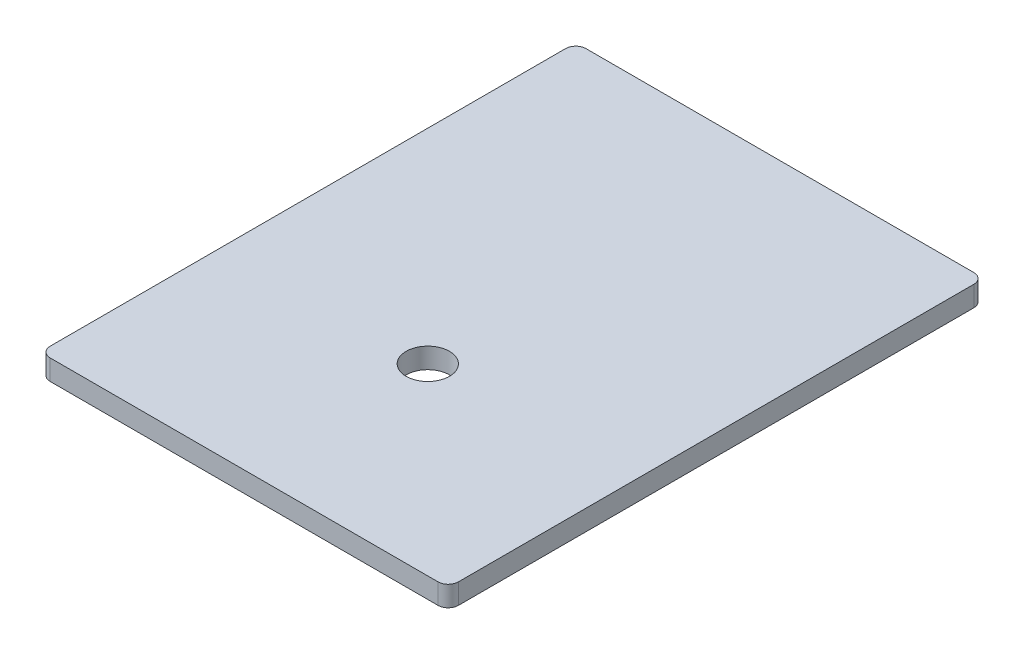
ISO-10303-21;
HEADER;
FILE_DESCRIPTION(('STEP AP214'),'2;1');
FILE_NAME('part.step','',(''),(''),'','','');
FILE_SCHEMA(('AUTOMOTIVE_DESIGN { 1 0 10303 214 1 1 1 1 }'));
ENDSEC;
DATA;
#1=APPLICATION_CONTEXT('core data for automotive mechanical design processes');
#2=APPLICATION_PROTOCOL_DEFINITION('international standard','automotive_design',2000,#1);
#3=PRODUCT_CONTEXT('',#1,'mechanical');
#4=PRODUCT('Part','Part','',(#3));
#5=PRODUCT_RELATED_PRODUCT_CATEGORY('part','',(#4));
#6=PRODUCT_DEFINITION_FORMATION('','',#4);
#7=PRODUCT_DEFINITION_CONTEXT('part definition',#1,'design');
#8=PRODUCT_DEFINITION('design','',#6,#7);
#9=PRODUCT_DEFINITION_SHAPE('','',#8);
#10=(LENGTH_UNIT() NAMED_UNIT(*) SI_UNIT(.MILLI.,.METRE.));
#11=(NAMED_UNIT(*) PLANE_ANGLE_UNIT() SI_UNIT($,.RADIAN.));
#12=(NAMED_UNIT(*) SI_UNIT($,.STERADIAN.) SOLID_ANGLE_UNIT());
#13=UNCERTAINTY_MEASURE_WITH_UNIT(LENGTH_MEASURE(1.E-05),#10,'distance_accuracy_value','');
#14=(GEOMETRIC_REPRESENTATION_CONTEXT(3) GLOBAL_UNCERTAINTY_ASSIGNED_CONTEXT((#13)) GLOBAL_UNIT_ASSIGNED_CONTEXT((#10,
#11,#12)) REPRESENTATION_CONTEXT('',''));
#15=CARTESIAN_POINT('',(0.,0.,0.));
#16=DIRECTION('',(0.,0.,1.));
#17=DIRECTION('',(1.,0.,0.));
#18=AXIS2_PLACEMENT_3D('',#15,#16,#17);
#19=CARTESIAN_POINT('',(-80.,-8.,-210.));
#20=DIRECTION('',(-1.,0.,0.));
#21=DIRECTION('',(0.,0.,1.));
#22=AXIS2_PLACEMENT_3D('',#19,#20,#21);
#23=PLANE('',#22);
#24=DIRECTION('',(0.,0.,1.));
#25=VECTOR('',#24,1.);
#26=CARTESIAN_POINT('',(-80.,0.,-210.));
#27=LINE('',#26,#25);
#28=CARTESIAN_POINT('',(-80.,0.,-206.));
#29=VERTEX_POINT('',#28);
#30=CARTESIAN_POINT('',(-80.,0.,-4.));
#31=VERTEX_POINT('',#30);
#32=EDGE_CURVE('E167',#29,#31,#27,.T.);
#33=ORIENTED_EDGE('',*,*,#32,.F.);
#34=DIRECTION('',(0.,1.,0.));
#35=VECTOR('',#34,1.);
#36=CARTESIAN_POINT('',(-80.,-8.,-206.));
#37=LINE('',#36,#35);
#38=CARTESIAN_POINT('',(-80.,-8.,-206.));
#39=VERTEX_POINT('',#38);
#40=EDGE_CURVE('E142',#29,#39,#37,.F.);
#41=ORIENTED_EDGE('',*,*,#40,.T.);
#42=DIRECTION('',(0.,0.,1.));
#43=VECTOR('',#42,1.);
#44=CARTESIAN_POINT('',(-80.,-8.,-210.));
#45=LINE('',#44,#43);
#46=CARTESIAN_POINT('',(-80.,-8.,-4.));
#47=VERTEX_POINT('',#46);
#48=EDGE_CURVE('E123',#39,#47,#45,.T.);
#49=ORIENTED_EDGE('',*,*,#48,.T.);
#50=DIRECTION('',(0.,1.,0.));
#51=VECTOR('',#50,1.);
#52=CARTESIAN_POINT('',(-80.,-8.,-4.));
#53=LINE('',#52,#51);
#54=EDGE_CURVE('E139',#47,#31,#53,.T.);
#55=ORIENTED_EDGE('',*,*,#54,.T.);
#56=EDGE_LOOP('',(#33,#41,#49,#55));
#57=FACE_BOUND('',#56,.T.);
#58=ADVANCED_FACE('F36',(#57),#23,.T.);
#59=CARTESIAN_POINT('',(-80.,-8.,-210.));
#60=DIRECTION('',(0.,0.,-1.));
#61=DIRECTION('',(-1.,0.,0.));
#62=AXIS2_PLACEMENT_3D('',#59,#60,#61);
#63=PLANE('',#62);
#64=DIRECTION('',(-1.,0.,0.));
#65=VECTOR('',#64,1.);
#66=CARTESIAN_POINT('',(-80.,-8.,-210.));
#67=LINE('',#66,#65);
#68=CARTESIAN_POINT('',(76.,-8.,-210.));
#69=VERTEX_POINT('',#68);
#70=CARTESIAN_POINT('',(-76.,-8.,-210.));
#71=VERTEX_POINT('',#70);
#72=EDGE_CURVE('E128',#69,#71,#67,.T.);
#73=ORIENTED_EDGE('',*,*,#72,.T.);
#74=DIRECTION('',(0.,1.,0.));
#75=VECTOR('',#74,1.);
#76=CARTESIAN_POINT('',(-76.,-8.,-210.));
#77=LINE('',#76,#75);
#78=CARTESIAN_POINT('',(-76.,0.,-210.));
#79=VERTEX_POINT('',#78);
#80=EDGE_CURVE('E122',#71,#79,#77,.T.);
#81=ORIENTED_EDGE('',*,*,#80,.T.);
#82=DIRECTION('',(-1.,0.,0.));
#83=VECTOR('',#82,1.);
#84=CARTESIAN_POINT('',(-80.,0.,-210.));
#85=LINE('',#84,#83);
#86=CARTESIAN_POINT('',(76.,0.,-210.));
#87=VERTEX_POINT('',#86);
#88=EDGE_CURVE('E106',#87,#79,#85,.T.);
#89=ORIENTED_EDGE('',*,*,#88,.F.);
#90=DIRECTION('',(0.,1.,0.));
#91=VECTOR('',#90,1.);
#92=CARTESIAN_POINT('',(76.,-8.,-210.));
#93=LINE('',#92,#91);
#94=EDGE_CURVE('E119',#87,#69,#93,.F.);
#95=ORIENTED_EDGE('',*,*,#94,.T.);
#96=EDGE_LOOP('',(#73,#81,#89,#95));
#97=FACE_BOUND('',#96,.T.);
#98=ADVANCED_FACE('F118',(#97),#63,.T.);
#99=CARTESIAN_POINT('',(80.,-8.,-210.));
#100=DIRECTION('',(1.,0.,0.));
#101=DIRECTION('',(0.,0.,-1.));
#102=AXIS2_PLACEMENT_3D('',#99,#100,#101);
#103=PLANE('',#102);
#104=DIRECTION('',(0.,0.,-1.));
#105=VECTOR('',#104,1.);
#106=CARTESIAN_POINT('',(80.,-8.,-210.));
#107=LINE('',#106,#105);
#108=CARTESIAN_POINT('',(80.,-8.,-4.));
#109=VERTEX_POINT('',#108);
#110=CARTESIAN_POINT('',(80.,-8.,-206.));
#111=VERTEX_POINT('',#110);
#112=EDGE_CURVE('E131',#109,#111,#107,.T.);
#113=ORIENTED_EDGE('',*,*,#112,.T.);
#114=DIRECTION('',(0.,1.,0.));
#115=VECTOR('',#114,1.);
#116=CARTESIAN_POINT('',(80.,-8.,-206.));
#117=LINE('',#116,#115);
#118=CARTESIAN_POINT('',(80.,0.,-206.));
#119=VERTEX_POINT('',#118);
#120=EDGE_CURVE('E11',#111,#119,#117,.T.);
#121=ORIENTED_EDGE('',*,*,#120,.T.);
#122=DIRECTION('',(0.,0.,-1.));
#123=VECTOR('',#122,1.);
#124=CARTESIAN_POINT('',(80.,0.,-210.));
#125=LINE('',#124,#123);
#126=CARTESIAN_POINT('',(80.,0.,-4.));
#127=VERTEX_POINT('',#126);
#128=EDGE_CURVE('E108',#127,#119,#125,.T.);
#129=ORIENTED_EDGE('',*,*,#128,.F.);
#130=DIRECTION('',(0.,1.,0.));
#131=VECTOR('',#130,1.);
#132=CARTESIAN_POINT('',(80.,-8.,-4.));
#133=LINE('',#132,#131);
#134=EDGE_CURVE('E44',#127,#109,#133,.F.);
#135=ORIENTED_EDGE('',*,*,#134,.T.);
#136=EDGE_LOOP('',(#113,#121,#129,#135));
#137=FACE_BOUND('',#136,.T.);
#138=ADVANCED_FACE('F156',(#137),#103,.T.);
#139=CARTESIAN_POINT('',(-80.,-8.,0.));
#140=DIRECTION('',(0.,0.,1.));
#141=DIRECTION('',(1.,0.,0.));
#142=AXIS2_PLACEMENT_3D('',#139,#140,#141);
#143=PLANE('',#142);
#144=DIRECTION('',(1.,0.,0.));
#145=VECTOR('',#144,1.);
#146=CARTESIAN_POINT('',(-80.,0.,0.));
#147=LINE('',#146,#145);
#148=CARTESIAN_POINT('',(-76.,0.,0.));
#149=VERTEX_POINT('',#148);
#150=CARTESIAN_POINT('',(76.,0.,0.));
#151=VERTEX_POINT('',#150);
#152=EDGE_CURVE('E165',#149,#151,#147,.T.);
#153=ORIENTED_EDGE('',*,*,#152,.F.);
#154=DIRECTION('',(0.,1.,0.));
#155=VECTOR('',#154,1.);
#156=CARTESIAN_POINT('',(-76.,-8.,0.));
#157=LINE('',#156,#155);
#158=CARTESIAN_POINT('',(-76.,-8.,0.));
#159=VERTEX_POINT('',#158);
#160=EDGE_CURVE('E58',#149,#159,#157,.F.);
#161=ORIENTED_EDGE('',*,*,#160,.T.);
#162=DIRECTION('',(1.,0.,0.));
#163=VECTOR('',#162,1.);
#164=CARTESIAN_POINT('',(-80.,-8.,0.));
#165=LINE('',#164,#163);
#166=CARTESIAN_POINT('',(76.,-8.,0.));
#167=VERTEX_POINT('',#166);
#168=EDGE_CURVE('E160',#159,#167,#165,.T.);
#169=ORIENTED_EDGE('',*,*,#168,.T.);
#170=DIRECTION('',(0.,1.,0.));
#171=VECTOR('',#170,1.);
#172=CARTESIAN_POINT('',(76.,-8.,0.));
#173=LINE('',#172,#171);
#174=EDGE_CURVE('E150',#167,#151,#173,.T.);
#175=ORIENTED_EDGE('',*,*,#174,.T.);
#176=EDGE_LOOP('',(#153,#161,#169,#175));
#177=FACE_BOUND('',#176,.T.);
#178=ADVANCED_FACE('F164',(#177),#143,.T.);
#179=CARTESIAN_POINT('',(0.,-8.,0.));
#180=DIRECTION('',(0.,1.,0.));
#181=DIRECTION('',(0.,0.,1.));
#182=AXIS2_PLACEMENT_3D('',#179,#180,#181);
#183=PLANE('',#182);
#184=CARTESIAN_POINT('',(0.,-8.,-72.));
#185=DIRECTION('',(0.,1.,0.));
#186=DIRECTION('',(0.,0.,1.));
#187=AXIS2_PLACEMENT_3D('',#184,#185,#186);
#188=CIRCLE('',#187,8.5);
#189=CARTESIAN_POINT('',(0.,-8.,-63.5));
#190=VERTEX_POINT('',#189);
#191=EDGE_CURVE('E169',#190,#190,#188,.T.);
#192=ORIENTED_EDGE('',*,*,#191,.T.);
#193=EDGE_LOOP('',(#192));
#194=FACE_BOUND('',#193,.T.);
#195=ORIENTED_EDGE('',*,*,#48,.F.);
#196=CARTESIAN_POINT('',(-76.,-8.,-206.));
#197=DIRECTION('',(0.,1.,0.));
#198=DIRECTION('',(0.,0.,1.));
#199=AXIS2_PLACEMENT_3D('',#196,#197,#198);
#200=CIRCLE('',#199,4.);
#201=EDGE_CURVE('E148',#39,#71,#200,.F.);
#202=ORIENTED_EDGE('',*,*,#201,.T.);
#203=ORIENTED_EDGE('',*,*,#72,.F.);
#204=CARTESIAN_POINT('',(76.,-8.,-206.));
#205=DIRECTION('',(0.,1.,0.));
#206=DIRECTION('',(0.,0.,1.));
#207=AXIS2_PLACEMENT_3D('',#204,#205,#206);
#208=CIRCLE('',#207,4.);
#209=EDGE_CURVE('E127',#69,#111,#208,.F.);
#210=ORIENTED_EDGE('',*,*,#209,.T.);
#211=ORIENTED_EDGE('',*,*,#112,.F.);
#212=CARTESIAN_POINT('',(76.,-8.,-4.));
#213=DIRECTION('',(0.,1.,0.));
#214=DIRECTION('',(0.,0.,1.));
#215=AXIS2_PLACEMENT_3D('',#212,#213,#214);
#216=CIRCLE('',#215,4.);
#217=EDGE_CURVE('E51',#109,#167,#216,.F.);
#218=ORIENTED_EDGE('',*,*,#217,.T.);
#219=ORIENTED_EDGE('',*,*,#168,.F.);
#220=CARTESIAN_POINT('',(-76.,-8.,-4.));
#221=DIRECTION('',(0.,1.,0.));
#222=DIRECTION('',(0.,0.,1.));
#223=AXIS2_PLACEMENT_3D('',#220,#221,#222);
#224=CIRCLE('',#223,4.);
#225=EDGE_CURVE('E146',#159,#47,#224,.F.);
#226=ORIENTED_EDGE('',*,*,#225,.T.);
#227=EDGE_LOOP('',(#195,#202,#203,#210,#211,#218,#219,#226));
#228=FACE_BOUND('',#227,.T.);
#229=ADVANCED_FACE('F159',(#194,#228),#183,.F.);
#230=CARTESIAN_POINT('',(0.,0.,0.));
#231=DIRECTION('',(0.,1.,0.));
#232=DIRECTION('',(0.,0.,1.));
#233=AXIS2_PLACEMENT_3D('',#230,#231,#232);
#234=PLANE('',#233);
#235=CARTESIAN_POINT('',(0.,0.,-72.));
#236=DIRECTION('',(0.,1.,0.));
#237=DIRECTION('',(0.,0.,1.));
#238=AXIS2_PLACEMENT_3D('',#235,#236,#237);
#239=CIRCLE('',#238,8.5);
#240=CARTESIAN_POINT('',(0.,0.,-63.5));
#241=VERTEX_POINT('',#240);
#242=EDGE_CURVE('E177',#241,#241,#239,.T.);
#243=ORIENTED_EDGE('',*,*,#242,.F.);
#244=EDGE_LOOP('',(#243));
#245=FACE_BOUND('',#244,.T.);
#246=ORIENTED_EDGE('',*,*,#88,.T.);
#247=CARTESIAN_POINT('',(-76.,0.,-206.));
#248=DIRECTION('',(0.,1.,0.));
#249=DIRECTION('',(0.,0.,1.));
#250=AXIS2_PLACEMENT_3D('',#247,#248,#249);
#251=CIRCLE('',#250,4.);
#252=EDGE_CURVE('E137',#79,#29,#251,.T.);
#253=ORIENTED_EDGE('',*,*,#252,.T.);
#254=ORIENTED_EDGE('',*,*,#32,.T.);
#255=CARTESIAN_POINT('',(-76.,0.,-4.));
#256=DIRECTION('',(0.,1.,0.));
#257=DIRECTION('',(0.,0.,1.));
#258=AXIS2_PLACEMENT_3D('',#255,#256,#257);
#259=CIRCLE('',#258,4.);
#260=EDGE_CURVE('E112',#31,#149,#259,.T.);
#261=ORIENTED_EDGE('',*,*,#260,.T.);
#262=ORIENTED_EDGE('',*,*,#152,.T.);
#263=CARTESIAN_POINT('',(76.,0.,-4.));
#264=DIRECTION('',(0.,1.,0.));
#265=DIRECTION('',(0.,0.,1.));
#266=AXIS2_PLACEMENT_3D('',#263,#264,#265);
#267=CIRCLE('',#266,4.);
#268=EDGE_CURVE('E113',#151,#127,#267,.T.);
#269=ORIENTED_EDGE('',*,*,#268,.T.);
#270=ORIENTED_EDGE('',*,*,#128,.T.);
#271=CARTESIAN_POINT('',(76.,0.,-206.));
#272=DIRECTION('',(0.,1.,0.));
#273=DIRECTION('',(0.,0.,1.));
#274=AXIS2_PLACEMENT_3D('',#271,#272,#273);
#275=CIRCLE('',#274,4.);
#276=EDGE_CURVE('E103',#119,#87,#275,.T.);
#277=ORIENTED_EDGE('',*,*,#276,.T.);
#278=EDGE_LOOP('',(#246,#253,#254,#261,#262,#269,#270,#277));
#279=FACE_BOUND('',#278,.T.);
#280=ADVANCED_FACE('F105',(#245,#279),#234,.T.);
#281=CARTESIAN_POINT('',(-76.,-8.,-206.));
#282=DIRECTION('',(0.,1.,0.));
#283=DIRECTION('',(0.,0.,1.));
#284=AXIS2_PLACEMENT_3D('',#281,#282,#283);
#285=CYLINDRICAL_SURFACE('',#284,4.);
#286=ORIENTED_EDGE('',*,*,#201,.F.);
#287=ORIENTED_EDGE('',*,*,#40,.F.);
#288=ORIENTED_EDGE('',*,*,#252,.F.);
#289=ORIENTED_EDGE('',*,*,#80,.F.);
#290=EDGE_LOOP('',(#286,#287,#288,#289));
#291=FACE_BOUND('',#290,.T.);
#292=ADVANCED_FACE('F185',(#291),#285,.T.);
#293=CARTESIAN_POINT('',(-76.,-8.,-4.));
#294=DIRECTION('',(0.,1.,0.));
#295=DIRECTION('',(0.,0.,1.));
#296=AXIS2_PLACEMENT_3D('',#293,#294,#295);
#297=CYLINDRICAL_SURFACE('',#296,4.);
#298=ORIENTED_EDGE('',*,*,#225,.F.);
#299=ORIENTED_EDGE('',*,*,#160,.F.);
#300=ORIENTED_EDGE('',*,*,#260,.F.);
#301=ORIENTED_EDGE('',*,*,#54,.F.);
#302=EDGE_LOOP('',(#298,#299,#300,#301));
#303=FACE_BOUND('',#302,.T.);
#304=ADVANCED_FACE('F192',(#303),#297,.T.);
#305=CARTESIAN_POINT('',(76.,-8.,-206.));
#306=DIRECTION('',(0.,1.,0.));
#307=DIRECTION('',(0.,0.,1.));
#308=AXIS2_PLACEMENT_3D('',#305,#306,#307);
#309=CYLINDRICAL_SURFACE('',#308,4.);
#310=ORIENTED_EDGE('',*,*,#209,.F.);
#311=ORIENTED_EDGE('',*,*,#94,.F.);
#312=ORIENTED_EDGE('',*,*,#276,.F.);
#313=ORIENTED_EDGE('',*,*,#120,.F.);
#314=EDGE_LOOP('',(#310,#311,#312,#313));
#315=FACE_BOUND('',#314,.T.);
#316=ADVANCED_FACE('F126',(#315),#309,.T.);
#317=CARTESIAN_POINT('',(76.,-8.,-4.));
#318=DIRECTION('',(0.,1.,0.));
#319=DIRECTION('',(0.,0.,1.));
#320=AXIS2_PLACEMENT_3D('',#317,#318,#319);
#321=CYLINDRICAL_SURFACE('',#320,4.);
#322=ORIENTED_EDGE('',*,*,#217,.F.);
#323=ORIENTED_EDGE('',*,*,#134,.F.);
#324=ORIENTED_EDGE('',*,*,#268,.F.);
#325=ORIENTED_EDGE('',*,*,#174,.F.);
#326=EDGE_LOOP('',(#322,#323,#324,#325));
#327=FACE_BOUND('',#326,.T.);
#328=ADVANCED_FACE('F38',(#327),#321,.T.);
#329=CARTESIAN_POINT('',(0.,-10.,-72.));
#330=DIRECTION('',(0.,1.,0.));
#331=DIRECTION('',(0.,0.,1.));
#332=AXIS2_PLACEMENT_3D('',#329,#330,#331);
#333=CYLINDRICAL_SURFACE('',#332,8.5);
#334=ORIENTED_EDGE('',*,*,#242,.T.);
#335=EDGE_LOOP('',(#334));
#336=FACE_BOUND('',#335,.T.);
#337=ORIENTED_EDGE('',*,*,#191,.F.);
#338=EDGE_LOOP('',(#337));
#339=FACE_BOUND('',#338,.T.);
#340=ADVANCED_FACE('F181',(#336,#339),#333,.F.);
#341=CLOSED_SHELL('',(#58,#98,#138,#178,#229,#280,#292,#304,#316,#328,#340));
#342=MANIFOLD_SOLID_BREP('B2',#341);
#343=ADVANCED_BREP_SHAPE_REPRESENTATION('',(#18,#342),#14);
#344=SHAPE_DEFINITION_REPRESENTATION(#9,#343);
ENDSEC;
END-ISO-10303-21;
